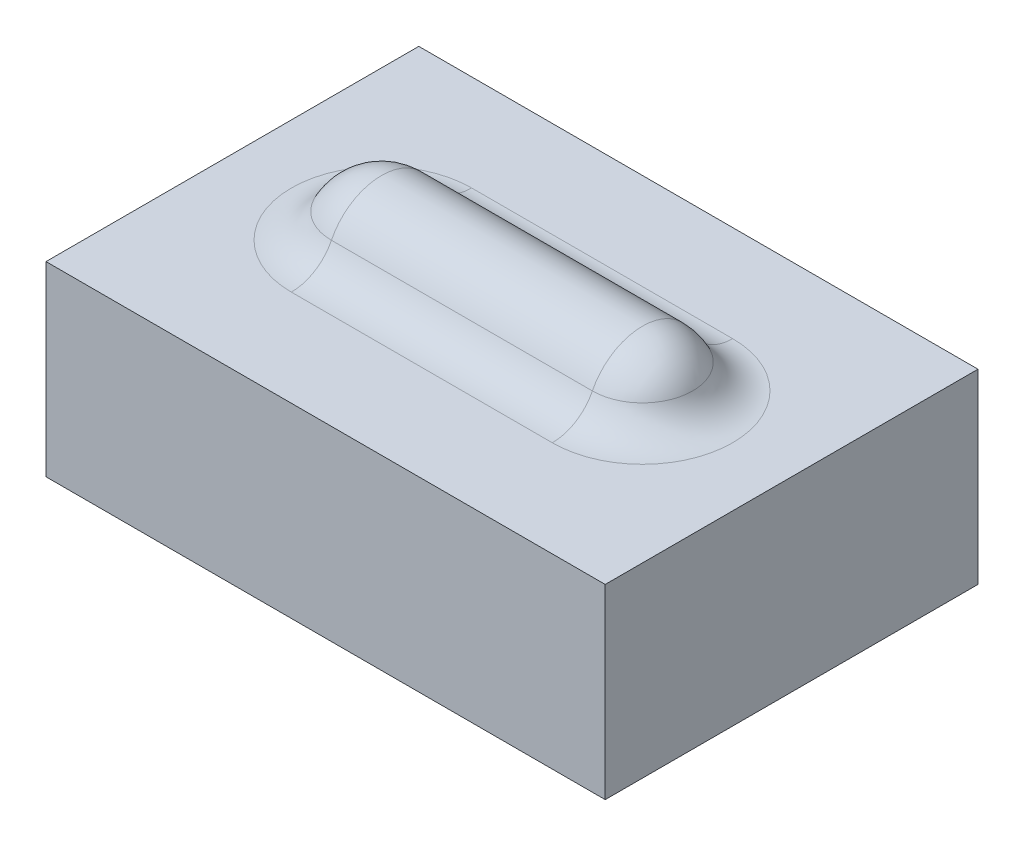
ISO-10303-21;
HEADER;
FILE_DESCRIPTION(('STEP AP214'),'2;1');
FILE_NAME('part.step','',(''),(''),'','','');
FILE_SCHEMA(('AUTOMOTIVE_DESIGN { 1 0 10303 214 1 1 1 1 }'));
ENDSEC;
DATA;
#1=APPLICATION_CONTEXT('core data for automotive mechanical design processes');
#2=APPLICATION_PROTOCOL_DEFINITION('international standard','automotive_design',2000,#1);
#3=PRODUCT_CONTEXT('',#1,'mechanical');
#4=PRODUCT('Part','Part','',(#3));
#5=PRODUCT_RELATED_PRODUCT_CATEGORY('part','',(#4));
#6=PRODUCT_DEFINITION_FORMATION('','',#4);
#7=PRODUCT_DEFINITION_CONTEXT('part definition',#1,'design');
#8=PRODUCT_DEFINITION('design','',#6,#7);
#9=PRODUCT_DEFINITION_SHAPE('','',#8);
#10=(LENGTH_UNIT() NAMED_UNIT(*) SI_UNIT(.MILLI.,.METRE.));
#11=(NAMED_UNIT(*) PLANE_ANGLE_UNIT() SI_UNIT($,.RADIAN.));
#12=(NAMED_UNIT(*) SI_UNIT($,.STERADIAN.) SOLID_ANGLE_UNIT());
#13=UNCERTAINTY_MEASURE_WITH_UNIT(LENGTH_MEASURE(1.E-05),#10,'distance_accuracy_value','');
#14=(GEOMETRIC_REPRESENTATION_CONTEXT(3) GLOBAL_UNCERTAINTY_ASSIGNED_CONTEXT((#13)) GLOBAL_UNIT_ASSIGNED_CONTEXT((#10,
#11,#12)) REPRESENTATION_CONTEXT('',''));
#15=CARTESIAN_POINT('',(0.,0.,0.));
#16=DIRECTION('',(0.,0.,1.));
#17=DIRECTION('',(1.,0.,0.));
#18=AXIS2_PLACEMENT_3D('',#15,#16,#17);
#19=CARTESIAN_POINT('',(0.,5.,0.));
#20=DIRECTION('',(0.,1.,0.));
#21=DIRECTION('',(0.,0.,1.));
#22=AXIS2_PLACEMENT_3D('',#19,#20,#21);
#23=PLANE('',#22);
#24=DIRECTION('',(-1.,0.,0.));
#25=VECTOR('',#24,1.);
#26=CARTESIAN_POINT('',(0.,5.,-2.41867732448957));
#27=LINE('',#26,#25);
#28=CARTESIAN_POINT('',(-3.5,5.,-2.41867732448957));
#29=VERTEX_POINT('',#28);
#30=CARTESIAN_POINT('',(3.5,5.,-2.41867732448957));
#31=VERTEX_POINT('',#30);
#32=EDGE_CURVE('E136',#29,#31,#27,.F.);
#33=ORIENTED_EDGE('',*,*,#32,.T.);
#34=CARTESIAN_POINT('',(3.5,5.,0.));
#35=DIRECTION('',(0.,1.,0.));
#36=DIRECTION('',(0.,0.,1.));
#37=AXIS2_PLACEMENT_3D('',#34,#35,#36);
#38=CIRCLE('',#37,2.41867732448957);
#39=CARTESIAN_POINT('',(3.5,5.,2.41867732448957));
#40=VERTEX_POINT('',#39);
#41=EDGE_CURVE('E138',#31,#40,#38,.F.);
#42=ORIENTED_EDGE('',*,*,#41,.T.);
#43=DIRECTION('',(-1.,0.,0.));
#44=VECTOR('',#43,1.);
#45=CARTESIAN_POINT('',(0.,5.,2.41867732448957));
#46=LINE('',#45,#44);
#47=CARTESIAN_POINT('',(-3.5,5.,2.41867732448957));
#48=VERTEX_POINT('',#47);
#49=EDGE_CURVE('E127',#40,#48,#46,.T.);
#50=ORIENTED_EDGE('',*,*,#49,.T.);
#51=CARTESIAN_POINT('',(-3.5,5.,0.));
#52=DIRECTION('',(0.,1.,0.));
#53=DIRECTION('',(0.,0.,1.));
#54=AXIS2_PLACEMENT_3D('',#51,#52,#53);
#55=CIRCLE('',#54,2.41867732448957);
#56=EDGE_CURVE('E129',#48,#29,#55,.F.);
#57=ORIENTED_EDGE('',*,*,#56,.T.);
#58=EDGE_LOOP('',(#33,#42,#50,#57));
#59=FACE_BOUND('',#58,.T.);
#60=DIRECTION('',(0.,0.,-1.));
#61=VECTOR('',#60,1.);
#62=CARTESIAN_POINT('',(7.5,5.,-5.));
#63=LINE('',#62,#61);
#64=CARTESIAN_POINT('',(7.5,5.,5.));
#65=VERTEX_POINT('',#64);
#66=CARTESIAN_POINT('',(7.5,5.,-5.));
#67=VERTEX_POINT('',#66);
#68=EDGE_CURVE('E114',#65,#67,#63,.T.);
#69=ORIENTED_EDGE('',*,*,#68,.T.);
#70=DIRECTION('',(-1.,0.,0.));
#71=VECTOR('',#70,1.);
#72=CARTESIAN_POINT('',(-7.5,5.,-5.));
#73=LINE('',#72,#71);
#74=CARTESIAN_POINT('',(-7.5,5.,-5.));
#75=VERTEX_POINT('',#74);
#76=EDGE_CURVE('E103',#67,#75,#73,.T.);
#77=ORIENTED_EDGE('',*,*,#76,.T.);
#78=DIRECTION('',(0.,0.,1.));
#79=VECTOR('',#78,1.);
#80=CARTESIAN_POINT('',(-7.5,5.,-5.));
#81=LINE('',#80,#79);
#82=CARTESIAN_POINT('',(-7.5,5.,5.));
#83=VERTEX_POINT('',#82);
#84=EDGE_CURVE('E113',#75,#83,#81,.T.);
#85=ORIENTED_EDGE('',*,*,#84,.T.);
#86=DIRECTION('',(1.,0.,0.));
#87=VECTOR('',#86,1.);
#88=CARTESIAN_POINT('',(-7.5,5.,5.));
#89=LINE('',#88,#87);
#90=EDGE_CURVE('E118',#83,#65,#89,.T.);
#91=ORIENTED_EDGE('',*,*,#90,.T.);
#92=EDGE_LOOP('',(#69,#77,#85,#91));
#93=FACE_BOUND('',#92,.T.);
#94=ADVANCED_FACE('F38',(#59,#93),#23,.T.);
#95=CARTESIAN_POINT('',(7.5,5.,-5.));
#96=DIRECTION('',(-1.,0.,0.));
#97=DIRECTION('',(0.,0.,1.));
#98=AXIS2_PLACEMENT_3D('',#95,#96,#97);
#99=PLANE('',#98);
#100=DIRECTION('',(0.,0.,-1.));
#101=VECTOR('',#100,1.);
#102=CARTESIAN_POINT('',(7.5,0.,-5.));
#103=LINE('',#102,#101);
#104=CARTESIAN_POINT('',(7.5,0.,5.));
#105=VERTEX_POINT('',#104);
#106=CARTESIAN_POINT('',(7.5,0.,-5.));
#107=VERTEX_POINT('',#106);
#108=EDGE_CURVE('E126',#105,#107,#103,.T.);
#109=ORIENTED_EDGE('',*,*,#108,.T.);
#110=DIRECTION('',(0.,-1.,0.));
#111=VECTOR('',#110,1.);
#112=CARTESIAN_POINT('',(7.5,5.,-5.));
#113=LINE('',#112,#111);
#114=EDGE_CURVE('E107',#67,#107,#113,.T.);
#115=ORIENTED_EDGE('',*,*,#114,.F.);
#116=ORIENTED_EDGE('',*,*,#68,.F.);
#117=DIRECTION('',(0.,-1.,0.));
#118=VECTOR('',#117,1.);
#119=CARTESIAN_POINT('',(7.5,5.,5.));
#120=LINE('',#119,#118);
#121=EDGE_CURVE('E167',#65,#105,#120,.T.);
#122=ORIENTED_EDGE('',*,*,#121,.T.);
#123=EDGE_LOOP('',(#109,#115,#116,#122));
#124=FACE_BOUND('',#123,.T.);
#125=ADVANCED_FACE('F124',(#124),#99,.F.);
#126=CARTESIAN_POINT('',(-7.5,5.,-5.));
#127=DIRECTION('',(0.,0.,1.));
#128=DIRECTION('',(1.,0.,0.));
#129=AXIS2_PLACEMENT_3D('',#126,#127,#128);
#130=PLANE('',#129);
#131=DIRECTION('',(-1.,0.,0.));
#132=VECTOR('',#131,1.);
#133=CARTESIAN_POINT('',(-7.5,0.,-5.));
#134=LINE('',#133,#132);
#135=CARTESIAN_POINT('',(-7.5,0.,-5.));
#136=VERTEX_POINT('',#135);
#137=EDGE_CURVE('E169',#107,#136,#134,.T.);
#138=ORIENTED_EDGE('',*,*,#137,.T.);
#139=DIRECTION('',(0.,-1.,0.));
#140=VECTOR('',#139,1.);
#141=CARTESIAN_POINT('',(-7.5,5.,-5.));
#142=LINE('',#141,#140);
#143=EDGE_CURVE('E110',#75,#136,#142,.T.);
#144=ORIENTED_EDGE('',*,*,#143,.F.);
#145=ORIENTED_EDGE('',*,*,#76,.F.);
#146=ORIENTED_EDGE('',*,*,#114,.T.);
#147=EDGE_LOOP('',(#138,#144,#145,#146));
#148=FACE_BOUND('',#147,.T.);
#149=ADVANCED_FACE('F105',(#148),#130,.F.);
#150=CARTESIAN_POINT('',(-7.5,5.,-5.));
#151=DIRECTION('',(1.,0.,0.));
#152=DIRECTION('',(0.,0.,-1.));
#153=AXIS2_PLACEMENT_3D('',#150,#151,#152);
#154=PLANE('',#153);
#155=DIRECTION('',(0.,0.,1.));
#156=VECTOR('',#155,1.);
#157=CARTESIAN_POINT('',(-7.5,0.,-5.));
#158=LINE('',#157,#156);
#159=CARTESIAN_POINT('',(-7.5,0.,5.));
#160=VERTEX_POINT('',#159);
#161=EDGE_CURVE('E171',#136,#160,#158,.T.);
#162=ORIENTED_EDGE('',*,*,#161,.T.);
#163=DIRECTION('',(0.,-1.,0.));
#164=VECTOR('',#163,1.);
#165=CARTESIAN_POINT('',(-7.5,5.,5.));
#166=LINE('',#165,#164);
#167=EDGE_CURVE('E131',#83,#160,#166,.T.);
#168=ORIENTED_EDGE('',*,*,#167,.F.);
#169=ORIENTED_EDGE('',*,*,#84,.F.);
#170=ORIENTED_EDGE('',*,*,#143,.T.);
#171=EDGE_LOOP('',(#162,#168,#169,#170));
#172=FACE_BOUND('',#171,.T.);
#173=ADVANCED_FACE('F183',(#172),#154,.F.);
#174=CARTESIAN_POINT('',(-7.5,5.,5.));
#175=DIRECTION('',(0.,0.,-1.));
#176=DIRECTION('',(-1.,0.,0.));
#177=AXIS2_PLACEMENT_3D('',#174,#175,#176);
#178=PLANE('',#177);
#179=DIRECTION('',(1.,0.,0.));
#180=VECTOR('',#179,1.);
#181=CARTESIAN_POINT('',(-7.5,0.,5.));
#182=LINE('',#181,#180);
#183=EDGE_CURVE('E122',#160,#105,#182,.T.);
#184=ORIENTED_EDGE('',*,*,#183,.T.);
#185=ORIENTED_EDGE('',*,*,#121,.F.);
#186=ORIENTED_EDGE('',*,*,#90,.F.);
#187=ORIENTED_EDGE('',*,*,#167,.T.);
#188=EDGE_LOOP('',(#184,#185,#186,#187));
#189=FACE_BOUND('',#188,.T.);
#190=ADVANCED_FACE('F178',(#189),#178,.F.);
#191=CARTESIAN_POINT('',(0.,0.,0.));
#192=DIRECTION('',(0.,1.,0.));
#193=DIRECTION('',(0.,0.,1.));
#194=AXIS2_PLACEMENT_3D('',#191,#192,#193);
#195=PLANE('',#194);
#196=ORIENTED_EDGE('',*,*,#108,.F.);
#197=ORIENTED_EDGE('',*,*,#183,.F.);
#198=ORIENTED_EDGE('',*,*,#161,.F.);
#199=ORIENTED_EDGE('',*,*,#137,.F.);
#200=EDGE_LOOP('',(#196,#197,#198,#199));
#201=FACE_BOUND('',#200,.T.);
#202=ADVANCED_FACE('F182',(#201),#195,.F.);
#203=CARTESIAN_POINT('',(-3.5,5.,0.));
#204=DIRECTION('',(-1.,0.,0.));
#205=DIRECTION('',(0.,1.,0.));
#206=AXIS2_PLACEMENT_3D('',#203,#204,#205);
#207=SPHERICAL_SURFACE('',#206,1.5);
#208=CARTESIAN_POINT('',(-3.5,5.,0.));
#209=DIRECTION('',(-1.,0.,0.));
#210=DIRECTION('',(0.,0.,1.));
#211=AXIS2_PLACEMENT_3D('',#208,#209,#210);
#212=CIRCLE('',#211,1.5);
#213=CARTESIAN_POINT('',(-3.5,5.66666666666667,1.34370962471643));
#214=VERTEX_POINT('',#213);
#215=CARTESIAN_POINT('',(-3.5,5.66666666666667,-1.34370962471643));
#216=VERTEX_POINT('',#215);
#217=EDGE_CURVE('E157',#214,#216,#212,.T.);
#218=ORIENTED_EDGE('',*,*,#217,.T.);
#219=CARTESIAN_POINT('',(-3.5,5.66666666666667,0.));
#220=DIRECTION('',(0.,-1.,0.));
#221=DIRECTION('',(0.,0.,-1.));
#222=AXIS2_PLACEMENT_3D('',#219,#220,#221);
#223=CIRCLE('',#222,1.34370962471643);
#224=EDGE_CURVE('E12',#216,#214,#223,.F.);
#225=ORIENTED_EDGE('',*,*,#224,.T.);
#226=EDGE_LOOP('',(#218,#225));
#227=FACE_BOUND('',#226,.T.);
#228=ADVANCED_FACE('F201',(#227),#207,.T.);
#229=CARTESIAN_POINT('',(3.5,5.,0.));
#230=DIRECTION('',(-1.,0.,0.));
#231=DIRECTION('',(0.,1.,0.));
#232=AXIS2_PLACEMENT_3D('',#229,#230,#231);
#233=SPHERICAL_SURFACE('',#232,1.5);
#234=CARTESIAN_POINT('',(3.5,5.,0.));
#235=DIRECTION('',(-1.,0.,0.));
#236=DIRECTION('',(0.,0.,1.));
#237=AXIS2_PLACEMENT_3D('',#234,#235,#236);
#238=CIRCLE('',#237,1.5);
#239=CARTESIAN_POINT('',(3.5,5.66666666666667,1.34370962471643));
#240=VERTEX_POINT('',#239);
#241=CARTESIAN_POINT('',(3.5,5.66666666666667,-1.34370962471643));
#242=VERTEX_POINT('',#241);
#243=EDGE_CURVE('E161',#240,#242,#238,.T.);
#244=ORIENTED_EDGE('',*,*,#243,.F.);
#245=CARTESIAN_POINT('',(3.5,5.66666666666667,0.));
#246=DIRECTION('',(0.,-1.,0.));
#247=DIRECTION('',(0.,0.,-1.));
#248=AXIS2_PLACEMENT_3D('',#245,#246,#247);
#249=CIRCLE('',#248,1.34370962471643);
#250=EDGE_CURVE('E141',#240,#242,#249,.F.);
#251=ORIENTED_EDGE('',*,*,#250,.T.);
#252=EDGE_LOOP('',(#244,#251));
#253=FACE_BOUND('',#252,.T.);
#254=ADVANCED_FACE('F207',(#253),#233,.T.);
#255=CARTESIAN_POINT('',(-7.5,5.,0.));
#256=DIRECTION('',(-1.,0.,0.));
#257=DIRECTION('',(0.,0.,1.));
#258=AXIS2_PLACEMENT_3D('',#255,#256,#257);
#259=CYLINDRICAL_SURFACE('',#258,1.5);
#260=ORIENTED_EDGE('',*,*,#243,.T.);
#261=DIRECTION('',(-1.,0.,0.));
#262=VECTOR('',#261,1.);
#263=CARTESIAN_POINT('',(-7.5,5.66666666666667,-1.34370962471643));
#264=LINE('',#263,#262);
#265=EDGE_CURVE('E47',#242,#216,#264,.T.);
#266=ORIENTED_EDGE('',*,*,#265,.T.);
#267=ORIENTED_EDGE('',*,*,#217,.F.);
#268=DIRECTION('',(-1.,0.,0.));
#269=VECTOR('',#268,1.);
#270=CARTESIAN_POINT('',(-7.5,5.66666666666667,1.34370962471643));
#271=LINE('',#270,#269);
#272=EDGE_CURVE('E144',#214,#240,#271,.F.);
#273=ORIENTED_EDGE('',*,*,#272,.T.);
#274=EDGE_LOOP('',(#260,#266,#267,#273));
#275=FACE_BOUND('',#274,.T.);
#276=ADVANCED_FACE('F211',(#275),#259,.T.);
#277=CARTESIAN_POINT('',(-3.5,6.2,0.));
#278=DIRECTION('',(0.,1.,0.));
#279=DIRECTION('',(0.,0.,1.));
#280=AXIS2_PLACEMENT_3D('',#277,#278,#279);
#281=TOROIDAL_SURFACE('',#280,2.41867732448957,1.2);
#282=CARTESIAN_POINT('',(-3.5,6.2,2.41867732448957));
#283=DIRECTION('',(-1.,0.,0.));
#284=DIRECTION('',(0.,0.,1.));
#285=AXIS2_PLACEMENT_3D('',#282,#283,#284);
#286=CIRCLE('',#285,1.2);
#287=EDGE_CURVE('E150',#214,#48,#286,.T.);
#288=ORIENTED_EDGE('',*,*,#287,.F.);
#289=ORIENTED_EDGE('',*,*,#224,.F.);
#290=CARTESIAN_POINT('',(-3.5,6.2,-2.41867732448957));
#291=DIRECTION('',(-1.,0.,0.));
#292=DIRECTION('',(0.,0.,1.));
#293=AXIS2_PLACEMENT_3D('',#290,#291,#292);
#294=CIRCLE('',#293,1.2);
#295=EDGE_CURVE('E42',#29,#216,#294,.T.);
#296=ORIENTED_EDGE('',*,*,#295,.F.);
#297=ORIENTED_EDGE('',*,*,#56,.F.);
#298=EDGE_LOOP('',(#288,#289,#296,#297));
#299=FACE_BOUND('',#298,.T.);
#300=ADVANCED_FACE('F40',(#299),#281,.F.);
#301=CARTESIAN_POINT('',(-7.5,6.2,-2.41867732448957));
#302=DIRECTION('',(-1.,0.,0.));
#303=DIRECTION('',(0.,0.,1.));
#304=AXIS2_PLACEMENT_3D('',#301,#302,#303);
#305=CYLINDRICAL_SURFACE('',#304,1.2);
#306=ORIENTED_EDGE('',*,*,#295,.T.);
#307=ORIENTED_EDGE('',*,*,#265,.F.);
#308=CARTESIAN_POINT('',(3.5,6.2,-2.41867732448957));
#309=DIRECTION('',(-1.,0.,0.));
#310=DIRECTION('',(0.,0.,1.));
#311=AXIS2_PLACEMENT_3D('',#308,#309,#310);
#312=CIRCLE('',#311,1.2);
#313=EDGE_CURVE('E149',#31,#242,#312,.T.);
#314=ORIENTED_EDGE('',*,*,#313,.F.);
#315=ORIENTED_EDGE('',*,*,#32,.F.);
#316=EDGE_LOOP('',(#306,#307,#314,#315));
#317=FACE_BOUND('',#316,.T.);
#318=ADVANCED_FACE('F226',(#317),#305,.F.);
#319=CARTESIAN_POINT('',(-7.5,6.2,2.41867732448957));
#320=DIRECTION('',(-1.,0.,0.));
#321=DIRECTION('',(0.,0.,1.));
#322=AXIS2_PLACEMENT_3D('',#319,#320,#321);
#323=CYLINDRICAL_SURFACE('',#322,1.2);
#324=ORIENTED_EDGE('',*,*,#287,.T.);
#325=ORIENTED_EDGE('',*,*,#49,.F.);
#326=CARTESIAN_POINT('',(3.5,6.2,2.41867732448957));
#327=DIRECTION('',(-1.,0.,0.));
#328=DIRECTION('',(0.,-1.,0.));
#329=AXIS2_PLACEMENT_3D('',#326,#327,#328);
#330=CIRCLE('',#329,1.2);
#331=EDGE_CURVE('E147',#240,#40,#330,.T.);
#332=ORIENTED_EDGE('',*,*,#331,.F.);
#333=ORIENTED_EDGE('',*,*,#272,.F.);
#334=EDGE_LOOP('',(#324,#325,#332,#333));
#335=FACE_BOUND('',#334,.T.);
#336=ADVANCED_FACE('F224',(#335),#323,.F.);
#337=CARTESIAN_POINT('',(3.5,6.2,0.));
#338=DIRECTION('',(0.,1.,0.));
#339=DIRECTION('',(0.,0.,1.));
#340=AXIS2_PLACEMENT_3D('',#337,#338,#339);
#341=TOROIDAL_SURFACE('',#340,2.41867732448957,1.2);
#342=ORIENTED_EDGE('',*,*,#313,.T.);
#343=ORIENTED_EDGE('',*,*,#250,.F.);
#344=ORIENTED_EDGE('',*,*,#331,.T.);
#345=ORIENTED_EDGE('',*,*,#41,.F.);
#346=EDGE_LOOP('',(#342,#343,#344,#345));
#347=FACE_BOUND('',#346,.T.);
#348=ADVANCED_FACE('F221',(#347),#341,.F.);
#349=CLOSED_SHELL('',(#94,#125,#149,#173,#190,#202,#228,#254,#276,#300,#318,#336,#348));
#350=MANIFOLD_SOLID_BREP('B2',#349);
#351=ADVANCED_BREP_SHAPE_REPRESENTATION('',(#18,#350),#14);
#352=SHAPE_DEFINITION_REPRESENTATION(#9,#351);
ENDSEC;
END-ISO-10303-21;
